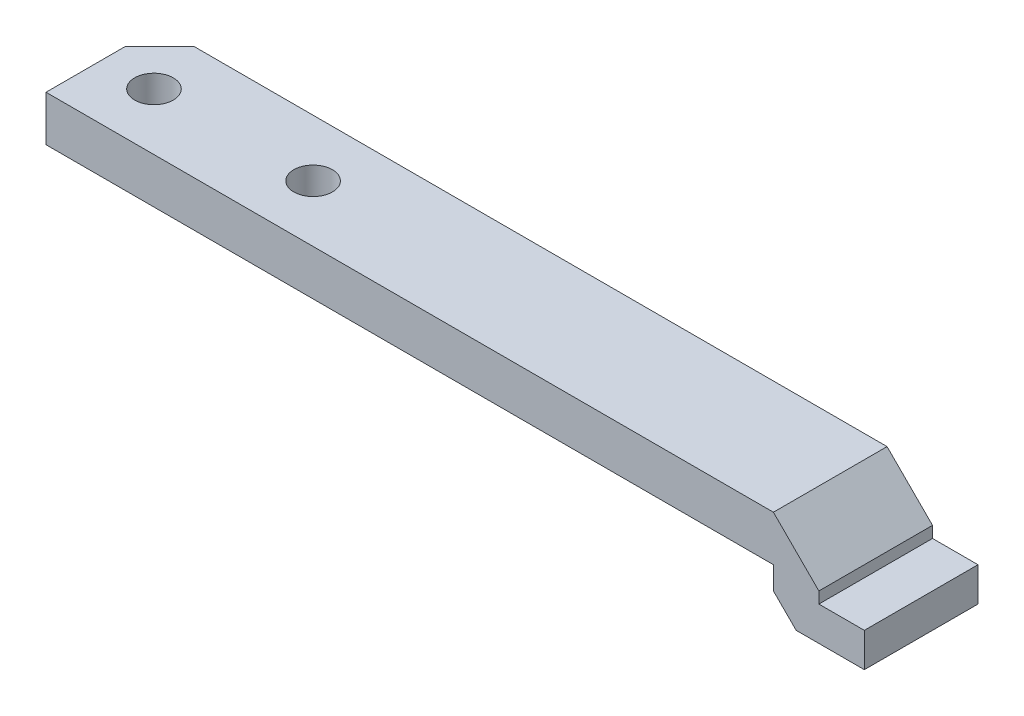
ISO-10303-21;
HEADER;
FILE_DESCRIPTION(('STEP AP214'),'2;1');
FILE_NAME('part.step','',(''),(''),'','','');
FILE_SCHEMA(('AUTOMOTIVE_DESIGN { 1 0 10303 214 1 1 1 1 }'));
ENDSEC;
DATA;
#1=APPLICATION_CONTEXT('core data for automotive mechanical design processes');
#2=APPLICATION_PROTOCOL_DEFINITION('international standard','automotive_design',2000,#1);
#3=PRODUCT_CONTEXT('',#1,'mechanical');
#4=PRODUCT('Part','Part','',(#3));
#5=PRODUCT_RELATED_PRODUCT_CATEGORY('part','',(#4));
#6=PRODUCT_DEFINITION_FORMATION('','',#4);
#7=PRODUCT_DEFINITION_CONTEXT('part definition',#1,'design');
#8=PRODUCT_DEFINITION('design','',#6,#7);
#9=PRODUCT_DEFINITION_SHAPE('','',#8);
#10=(LENGTH_UNIT() NAMED_UNIT(*) SI_UNIT(.MILLI.,.METRE.));
#11=(NAMED_UNIT(*) PLANE_ANGLE_UNIT() SI_UNIT($,.RADIAN.));
#12=(NAMED_UNIT(*) SI_UNIT($,.STERADIAN.) SOLID_ANGLE_UNIT());
#13=UNCERTAINTY_MEASURE_WITH_UNIT(LENGTH_MEASURE(1.E-05),#10,'distance_accuracy_value','');
#14=(GEOMETRIC_REPRESENTATION_CONTEXT(3) GLOBAL_UNCERTAINTY_ASSIGNED_CONTEXT((#13)) GLOBAL_UNIT_ASSIGNED_CONTEXT((#10,
#11,#12)) REPRESENTATION_CONTEXT('',''));
#15=CARTESIAN_POINT('',(0.,0.,0.));
#16=DIRECTION('',(0.,0.,1.));
#17=DIRECTION('',(1.,0.,0.));
#18=AXIS2_PLACEMENT_3D('',#15,#16,#17);
#19=CARTESIAN_POINT('',(26.3314487114034,2.49773558261549,10.));
#20=DIRECTION('',(-1.,0.,0.));
#21=DIRECTION('',(0.,0.,1.));
#22=AXIS2_PLACEMENT_3D('',#19,#20,#21);
#23=PLANE('',#22);
#24=DIRECTION('',(0.,1.,0.));
#25=VECTOR('',#24,1.);
#26=CARTESIAN_POINT('',(26.3314487114034,2.49773558261549,0.));
#27=LINE('',#26,#25);
#28=CARTESIAN_POINT('',(26.3314487114034,2.49773558261549,0.));
#29=VERTEX_POINT('',#28);
#30=CARTESIAN_POINT('',(26.3314487114034,3.49773558261547,0.));
#31=VERTEX_POINT('',#30);
#32=EDGE_CURVE('E157',#29,#31,#27,.T.);
#33=ORIENTED_EDGE('',*,*,#32,.T.);
#34=DIRECTION('',(0.,0.,1.));
#35=VECTOR('',#34,1.);
#36=CARTESIAN_POINT('',(26.3314487114034,3.49773558261547,10.));
#37=LINE('',#36,#35);
#38=CARTESIAN_POINT('',(26.3314487114034,3.49773558261547,10.));
#39=VERTEX_POINT('',#38);
#40=EDGE_CURVE('E196',#31,#39,#37,.T.);
#41=ORIENTED_EDGE('',*,*,#40,.T.);
#42=DIRECTION('',(0.,1.,0.));
#43=VECTOR('',#42,1.);
#44=CARTESIAN_POINT('',(26.3314487114034,2.49773558261549,10.));
#45=LINE('',#44,#43);
#46=CARTESIAN_POINT('',(26.3314487114034,2.49773558261549,10.));
#47=VERTEX_POINT('',#46);
#48=EDGE_CURVE('E127',#47,#39,#45,.T.);
#49=ORIENTED_EDGE('',*,*,#48,.F.);
#50=DIRECTION('',(0.,0.,-1.));
#51=VECTOR('',#50,1.);
#52=CARTESIAN_POINT('',(26.3314487114034,2.49773558261549,10.));
#53=LINE('',#52,#51);
#54=EDGE_CURVE('E156',#47,#29,#53,.T.);
#55=ORIENTED_EDGE('',*,*,#54,.T.);
#56=EDGE_LOOP('',(#33,#41,#49,#55));
#57=FACE_BOUND('',#56,.T.);
#58=ADVANCED_FACE('F33',(#57),#23,.F.);
#59=CARTESIAN_POINT('',(26.3314487114034,7.49773558261549,10.));
#60=DIRECTION('',(0.,-1.,0.));
#61=DIRECTION('',(1.,0.,0.));
#62=AXIS2_PLACEMENT_3D('',#59,#60,#61);
#63=PLANE('',#62);
#64=CARTESIAN_POINT('',(-23.1685512885966,7.49773558261548,5.));
#65=DIRECTION('',(0.,1.,0.));
#66=DIRECTION('',(-1.,0.,0.));
#67=AXIS2_PLACEMENT_3D('',#64,#65,#66);
#68=CIRCLE('',#67,1.7);
#69=CARTESIAN_POINT('',(-24.8685512885966,7.49773558261548,5.));
#70=VERTEX_POINT('',#69);
#71=EDGE_CURVE('E360',#70,#70,#68,.T.);
#72=ORIENTED_EDGE('',*,*,#71,.F.);
#73=EDGE_LOOP('',(#72));
#74=FACE_BOUND('',#73,.T.);
#75=CARTESIAN_POINT('',(-37.1685512885966,7.49773558261547,5.));
#76=DIRECTION('',(0.,1.,0.));
#77=DIRECTION('',(-1.,0.,0.));
#78=AXIS2_PLACEMENT_3D('',#75,#76,#77);
#79=CIRCLE('',#78,1.7);
#80=CARTESIAN_POINT('',(-38.8685512885966,7.49773558261547,5.));
#81=VERTEX_POINT('',#80);
#82=EDGE_CURVE('E365',#81,#81,#79,.T.);
#83=ORIENTED_EDGE('',*,*,#82,.F.);
#84=EDGE_LOOP('',(#83));
#85=FACE_BOUND('',#84,.T.);
#86=DIRECTION('',(-1.,0.,0.));
#87=VECTOR('',#86,1.);
#88=CARTESIAN_POINT('',(26.3314487114034,7.49773558261549,10.));
#89=LINE('',#88,#87);
#90=CARTESIAN_POINT('',(22.3314487114034,7.49773558261549,10.));
#91=VERTEX_POINT('',#90);
#92=CARTESIAN_POINT('',(-41.6685512885966,7.49773558261547,10.));
#93=VERTEX_POINT('',#92);
#94=EDGE_CURVE('E115',#91,#93,#89,.T.);
#95=ORIENTED_EDGE('',*,*,#94,.F.);
#96=DIRECTION('',(0.,0.,-1.));
#97=VECTOR('',#96,1.);
#98=CARTESIAN_POINT('',(22.3314487114034,7.49773558261549,10.));
#99=LINE('',#98,#97);
#100=CARTESIAN_POINT('',(22.3314487114034,7.49773558261549,0.));
#101=VERTEX_POINT('',#100);
#102=EDGE_CURVE('E192',#91,#101,#99,.T.);
#103=ORIENTED_EDGE('',*,*,#102,.T.);
#104=DIRECTION('',(-1.,0.,0.));
#105=VECTOR('',#104,1.);
#106=CARTESIAN_POINT('',(26.3314487114034,7.49773558261549,0.));
#107=LINE('',#106,#105);
#108=CARTESIAN_POINT('',(-38.6685512885965,7.49773558261547,0.));
#109=VERTEX_POINT('',#108);
#110=EDGE_CURVE('E160',#101,#109,#107,.T.);
#111=ORIENTED_EDGE('',*,*,#110,.T.);
#112=DIRECTION('',(0.707106781186548,0.,-0.707106781186547));
#113=VECTOR('',#112,1.);
#114=CARTESIAN_POINT('',(-41.6685512885966,7.49773558261547,3.00000000000002));
#115=LINE('',#114,#113);
#116=CARTESIAN_POINT('',(-41.6685512885966,7.49773558261547,3.00000000000002));
#117=VERTEX_POINT('',#116);
#118=EDGE_CURVE('E133',#109,#117,#115,.F.);
#119=ORIENTED_EDGE('',*,*,#118,.T.);
#120=DIRECTION('',(0.,0.,-1.));
#121=VECTOR('',#120,1.);
#122=CARTESIAN_POINT('',(-41.6685512885966,7.49773558261547,10.));
#123=LINE('',#122,#121);
#124=EDGE_CURVE('E130',#93,#117,#123,.T.);
#125=ORIENTED_EDGE('',*,*,#124,.F.);
#126=EDGE_LOOP('',(#95,#103,#111,#119,#125));
#127=FACE_BOUND('',#126,.T.);
#128=ADVANCED_FACE('F131',(#74,#85,#127),#63,.F.);
#129=CARTESIAN_POINT('',(-41.6685512885966,7.49773558261547,10.));
#130=DIRECTION('',(1.,0.,0.));
#131=DIRECTION('',(0.,0.,-1.));
#132=AXIS2_PLACEMENT_3D('',#129,#130,#131);
#133=PLANE('',#132);
#134=ORIENTED_EDGE('',*,*,#124,.T.);
#135=DIRECTION('',(0.,-1.,0.));
#136=VECTOR('',#135,1.);
#137=CARTESIAN_POINT('',(-41.6685512885966,7.49773558261547,3.00000000000002));
#138=LINE('',#137,#136);
#139=CARTESIAN_POINT('',(-41.6685512885966,3.49773558261547,3.00000000000002));
#140=VERTEX_POINT('',#139);
#141=EDGE_CURVE('E137',#117,#140,#138,.T.);
#142=ORIENTED_EDGE('',*,*,#141,.T.);
#143=DIRECTION('',(0.,0.,-1.));
#144=VECTOR('',#143,1.);
#145=CARTESIAN_POINT('',(-41.6685512885966,3.49773558261547,10.));
#146=LINE('',#145,#144);
#147=CARTESIAN_POINT('',(-41.6685512885966,3.49773558261547,10.));
#148=VERTEX_POINT('',#147);
#149=EDGE_CURVE('E138',#148,#140,#146,.T.);
#150=ORIENTED_EDGE('',*,*,#149,.F.);
#151=DIRECTION('',(0.,-1.,0.));
#152=VECTOR('',#151,1.);
#153=CARTESIAN_POINT('',(-41.6685512885966,7.49773558261547,10.));
#154=LINE('',#153,#152);
#155=EDGE_CURVE('E119',#93,#148,#154,.T.);
#156=ORIENTED_EDGE('',*,*,#155,.F.);
#157=EDGE_LOOP('',(#134,#142,#150,#156));
#158=FACE_BOUND('',#157,.T.);
#159=ADVANCED_FACE('F140',(#158),#133,.F.);
#160=CARTESIAN_POINT('',(-41.6685512885966,3.49773558261547,10.));
#161=DIRECTION('',(0.,1.,0.));
#162=DIRECTION('',(-1.,0.,0.));
#163=AXIS2_PLACEMENT_3D('',#160,#161,#162);
#164=PLANE('',#163);
#165=CARTESIAN_POINT('',(-23.1685512885966,3.49773558261548,5.));
#166=DIRECTION('',(0.,1.,0.));
#167=DIRECTION('',(-1.,0.,0.));
#168=AXIS2_PLACEMENT_3D('',#165,#166,#167);
#169=CIRCLE('',#168,1.7);
#170=CARTESIAN_POINT('',(-24.8685512885966,3.49773558261548,5.));
#171=VERTEX_POINT('',#170);
#172=EDGE_CURVE('E363',#171,#171,#169,.F.);
#173=ORIENTED_EDGE('',*,*,#172,.F.);
#174=EDGE_LOOP('',(#173));
#175=FACE_BOUND('',#174,.T.);
#176=CARTESIAN_POINT('',(-37.1685512885966,3.49773558261547,5.));
#177=DIRECTION('',(0.,1.,0.));
#178=DIRECTION('',(-1.,0.,0.));
#179=AXIS2_PLACEMENT_3D('',#176,#177,#178);
#180=CIRCLE('',#179,1.7);
#181=CARTESIAN_POINT('',(-38.8685512885966,3.49773558261547,5.));
#182=VERTEX_POINT('',#181);
#183=EDGE_CURVE('E161',#182,#182,#180,.F.);
#184=ORIENTED_EDGE('',*,*,#183,.F.);
#185=EDGE_LOOP('',(#184));
#186=FACE_BOUND('',#185,.T.);
#187=ORIENTED_EDGE('',*,*,#149,.T.);
#188=DIRECTION('',(-0.707106781186548,0.,0.707106781186547));
#189=VECTOR('',#188,1.);
#190=CARTESIAN_POINT('',(-41.6685512885966,3.49773558261547,3.00000000000002));
#191=LINE('',#190,#189);
#192=CARTESIAN_POINT('',(-38.6685512885965,3.49773558261547,0.));
#193=VERTEX_POINT('',#192);
#194=EDGE_CURVE('E186',#140,#193,#191,.F.);
#195=ORIENTED_EDGE('',*,*,#194,.T.);
#196=DIRECTION('',(1.,0.,0.));
#197=VECTOR('',#196,1.);
#198=CARTESIAN_POINT('',(-41.6685512885966,3.49773558261547,0.));
#199=LINE('',#198,#197);
#200=CARTESIAN_POINT('',(22.3314487114034,3.49773558261548,0.));
#201=VERTEX_POINT('',#200);
#202=EDGE_CURVE('E163',#193,#201,#199,.T.);
#203=ORIENTED_EDGE('',*,*,#202,.T.);
#204=DIRECTION('',(0.,0.,-1.));
#205=VECTOR('',#204,1.);
#206=CARTESIAN_POINT('',(22.3314487114034,3.49773558261548,10.));
#207=LINE('',#206,#205);
#208=CARTESIAN_POINT('',(22.3314487114034,3.49773558261548,10.));
#209=VERTEX_POINT('',#208);
#210=EDGE_CURVE('E181',#209,#201,#207,.T.);
#211=ORIENTED_EDGE('',*,*,#210,.F.);
#212=DIRECTION('',(1.,0.,0.));
#213=VECTOR('',#212,1.);
#214=CARTESIAN_POINT('',(-41.6685512885966,3.49773558261547,10.));
#215=LINE('',#214,#213);
#216=EDGE_CURVE('E143',#148,#209,#215,.T.);
#217=ORIENTED_EDGE('',*,*,#216,.F.);
#218=EDGE_LOOP('',(#187,#195,#203,#211,#217));
#219=FACE_BOUND('',#218,.T.);
#220=ADVANCED_FACE('F252',(#175,#186,#219),#164,.F.);
#221=CARTESIAN_POINT('',(22.3314487114034,3.49773558261548,10.));
#222=DIRECTION('',(1.,0.,0.));
#223=DIRECTION('',(0.,0.,-1.));
#224=AXIS2_PLACEMENT_3D('',#221,#222,#223);
#225=PLANE('',#224);
#226=DIRECTION('',(0.,-1.,0.));
#227=VECTOR('',#226,1.);
#228=CARTESIAN_POINT('',(22.3314487114034,3.49773558261548,0.));
#229=LINE('',#228,#227);
#230=CARTESIAN_POINT('',(22.3314487114034,1.4977355826155,0.));
#231=VERTEX_POINT('',#230);
#232=EDGE_CURVE('E165',#201,#231,#229,.T.);
#233=ORIENTED_EDGE('',*,*,#232,.T.);
#234=DIRECTION('',(0.,0.,1.));
#235=VECTOR('',#234,1.);
#236=CARTESIAN_POINT('',(22.3314487114034,1.4977355826155,10.));
#237=LINE('',#236,#235);
#238=CARTESIAN_POINT('',(22.3314487114034,1.4977355826155,10.));
#239=VERTEX_POINT('',#238);
#240=EDGE_CURVE('E41',#231,#239,#237,.T.);
#241=ORIENTED_EDGE('',*,*,#240,.T.);
#242=DIRECTION('',(0.,-1.,0.));
#243=VECTOR('',#242,1.);
#244=CARTESIAN_POINT('',(22.3314487114034,3.49773558261548,10.));
#245=LINE('',#244,#243);
#246=EDGE_CURVE('E145',#209,#239,#245,.T.);
#247=ORIENTED_EDGE('',*,*,#246,.F.);
#248=ORIENTED_EDGE('',*,*,#210,.T.);
#249=EDGE_LOOP('',(#233,#241,#247,#248));
#250=FACE_BOUND('',#249,.T.);
#251=ADVANCED_FACE('F255',(#250),#225,.F.);
#252=CARTESIAN_POINT('',(22.3314487114034,-0.502264417384507,10.));
#253=DIRECTION('',(0.,1.,0.));
#254=DIRECTION('',(0.,0.,1.));
#255=AXIS2_PLACEMENT_3D('',#252,#253,#254);
#256=PLANE('',#255);
#257=DIRECTION('',(1.,0.,0.));
#258=VECTOR('',#257,1.);
#259=CARTESIAN_POINT('',(22.3314487114034,-0.502264417384507,10.));
#260=LINE('',#259,#258);
#261=CARTESIAN_POINT('',(24.3314487114034,-0.502264417384507,10.));
#262=VERTEX_POINT('',#261);
#263=CARTESIAN_POINT('',(30.3314487114034,-0.502264417384507,10.));
#264=VERTEX_POINT('',#263);
#265=EDGE_CURVE('E150',#262,#264,#260,.T.);
#266=ORIENTED_EDGE('',*,*,#265,.F.);
#267=DIRECTION('',(0.,0.,-1.));
#268=VECTOR('',#267,1.);
#269=CARTESIAN_POINT('',(24.3314487114034,-0.502264417384507,10.));
#270=LINE('',#269,#268);
#271=CARTESIAN_POINT('',(24.3314487114034,-0.502264417384507,0.));
#272=VERTEX_POINT('',#271);
#273=EDGE_CURVE('E199',#262,#272,#270,.T.);
#274=ORIENTED_EDGE('',*,*,#273,.T.);
#275=DIRECTION('',(1.,0.,0.));
#276=VECTOR('',#275,1.);
#277=CARTESIAN_POINT('',(22.3314487114034,-0.502264417384507,0.));
#278=LINE('',#277,#276);
#279=CARTESIAN_POINT('',(30.3314487114034,-0.502264417384507,0.));
#280=VERTEX_POINT('',#279);
#281=EDGE_CURVE('E167',#272,#280,#278,.T.);
#282=ORIENTED_EDGE('',*,*,#281,.T.);
#283=DIRECTION('',(0.,0.,-1.));
#284=VECTOR('',#283,1.);
#285=CARTESIAN_POINT('',(30.3314487114034,-0.502264417384507,10.));
#286=LINE('',#285,#284);
#287=EDGE_CURVE('E178',#264,#280,#286,.T.);
#288=ORIENTED_EDGE('',*,*,#287,.F.);
#289=EDGE_LOOP('',(#266,#274,#282,#288));
#290=FACE_BOUND('',#289,.T.);
#291=ADVANCED_FACE('F205',(#290),#256,.F.);
#292=CARTESIAN_POINT('',(30.3314487114034,-0.502264417384507,10.));
#293=DIRECTION('',(-1.,0.,0.));
#294=DIRECTION('',(0.,0.,1.));
#295=AXIS2_PLACEMENT_3D('',#292,#293,#294);
#296=PLANE('',#295);
#297=DIRECTION('',(0.,1.,0.));
#298=VECTOR('',#297,1.);
#299=CARTESIAN_POINT('',(30.3314487114034,-0.502264417384507,0.));
#300=LINE('',#299,#298);
#301=CARTESIAN_POINT('',(30.3314487114034,2.49773558261549,0.));
#302=VERTEX_POINT('',#301);
#303=EDGE_CURVE('E169',#280,#302,#300,.T.);
#304=ORIENTED_EDGE('',*,*,#303,.T.);
#305=DIRECTION('',(0.,0.,-1.));
#306=VECTOR('',#305,1.);
#307=CARTESIAN_POINT('',(30.3314487114034,2.49773558261549,10.));
#308=LINE('',#307,#306);
#309=CARTESIAN_POINT('',(30.3314487114034,2.49773558261549,10.));
#310=VERTEX_POINT('',#309);
#311=EDGE_CURVE('E175',#310,#302,#308,.T.);
#312=ORIENTED_EDGE('',*,*,#311,.F.);
#313=DIRECTION('',(0.,1.,0.));
#314=VECTOR('',#313,1.);
#315=CARTESIAN_POINT('',(30.3314487114034,-0.502264417384507,10.));
#316=LINE('',#315,#314);
#317=EDGE_CURVE('E152',#264,#310,#316,.T.);
#318=ORIENTED_EDGE('',*,*,#317,.F.);
#319=ORIENTED_EDGE('',*,*,#287,.T.);
#320=EDGE_LOOP('',(#304,#312,#318,#319));
#321=FACE_BOUND('',#320,.T.);
#322=ADVANCED_FACE('F215',(#321),#296,.F.);
#323=CARTESIAN_POINT('',(30.3314487114034,2.49773558261549,10.));
#324=DIRECTION('',(0.,-1.,0.));
#325=DIRECTION('',(1.,0.,0.));
#326=AXIS2_PLACEMENT_3D('',#323,#324,#325);
#327=PLANE('',#326);
#328=DIRECTION('',(-1.,0.,0.));
#329=VECTOR('',#328,1.);
#330=CARTESIAN_POINT('',(30.3314487114034,2.49773558261549,0.));
#331=LINE('',#330,#329);
#332=EDGE_CURVE('E171',#302,#29,#331,.T.);
#333=ORIENTED_EDGE('',*,*,#332,.T.);
#334=ORIENTED_EDGE('',*,*,#54,.F.);
#335=DIRECTION('',(-1.,0.,0.));
#336=VECTOR('',#335,1.);
#337=CARTESIAN_POINT('',(30.3314487114034,2.49773558261549,10.));
#338=LINE('',#337,#336);
#339=EDGE_CURVE('E154',#310,#47,#338,.T.);
#340=ORIENTED_EDGE('',*,*,#339,.F.);
#341=ORIENTED_EDGE('',*,*,#311,.T.);
#342=EDGE_LOOP('',(#333,#334,#340,#341));
#343=FACE_BOUND('',#342,.T.);
#344=ADVANCED_FACE('F219',(#343),#327,.F.);
#345=CARTESIAN_POINT('',(0.,0.,10.));
#346=DIRECTION('',(0.,0.,1.));
#347=DIRECTION('',(1.,0.,0.));
#348=AXIS2_PLACEMENT_3D('',#345,#346,#347);
#349=PLANE('',#348);
#350=ORIENTED_EDGE('',*,*,#246,.T.);
#351=DIRECTION('',(-0.707106781186545,0.70710678118655,0.));
#352=VECTOR('',#351,1.);
#353=CARTESIAN_POINT('',(11.9145921470095,11.9145921470095,10.));
#354=LINE('',#353,#352);
#355=EDGE_CURVE('E11',#239,#262,#354,.F.);
#356=ORIENTED_EDGE('',*,*,#355,.T.);
#357=ORIENTED_EDGE('',*,*,#265,.T.);
#358=ORIENTED_EDGE('',*,*,#317,.T.);
#359=ORIENTED_EDGE('',*,*,#339,.T.);
#360=ORIENTED_EDGE('',*,*,#48,.T.);
#361=DIRECTION('',(0.707106781186546,-0.707106781186549,0.));
#362=VECTOR('',#361,1.);
#363=CARTESIAN_POINT('',(14.9145921470095,14.9145921470094,10.));
#364=LINE('',#363,#362);
#365=EDGE_CURVE('E123',#39,#91,#364,.F.);
#366=ORIENTED_EDGE('',*,*,#365,.T.);
#367=ORIENTED_EDGE('',*,*,#94,.T.);
#368=ORIENTED_EDGE('',*,*,#155,.T.);
#369=ORIENTED_EDGE('',*,*,#216,.T.);
#370=EDGE_LOOP('',(#350,#356,#357,#358,#359,#360,#366,#367,#368,#369));
#371=FACE_BOUND('',#370,.T.);
#372=ADVANCED_FACE('F117',(#371),#349,.T.);
#373=CARTESIAN_POINT('',(0.,0.,0.));
#374=DIRECTION('',(0.,0.,1.));
#375=DIRECTION('',(1.,0.,0.));
#376=AXIS2_PLACEMENT_3D('',#373,#374,#375);
#377=PLANE('',#376);
#378=ORIENTED_EDGE('',*,*,#281,.F.);
#379=DIRECTION('',(0.707106781186545,-0.70710678118655,0.));
#380=VECTOR('',#379,1.);
#381=CARTESIAN_POINT('',(24.3314487114034,-0.502264417384507,0.));
#382=LINE('',#381,#380);
#383=EDGE_CURVE('E55',#272,#231,#382,.F.);
#384=ORIENTED_EDGE('',*,*,#383,.T.);
#385=ORIENTED_EDGE('',*,*,#232,.F.);
#386=ORIENTED_EDGE('',*,*,#202,.F.);
#387=DIRECTION('',(0.,1.,0.));
#388=VECTOR('',#387,1.);
#389=CARTESIAN_POINT('',(-38.6685512885965,0.,0.));
#390=LINE('',#389,#388);
#391=EDGE_CURVE('E188',#193,#109,#390,.T.);
#392=ORIENTED_EDGE('',*,*,#391,.T.);
#393=ORIENTED_EDGE('',*,*,#110,.F.);
#394=DIRECTION('',(-0.707106781186546,0.707106781186549,0.));
#395=VECTOR('',#394,1.);
#396=CARTESIAN_POINT('',(22.3314487114034,7.49773558261549,0.));
#397=LINE('',#396,#395);
#398=EDGE_CURVE('E194',#101,#31,#397,.F.);
#399=ORIENTED_EDGE('',*,*,#398,.T.);
#400=ORIENTED_EDGE('',*,*,#32,.F.);
#401=ORIENTED_EDGE('',*,*,#332,.F.);
#402=ORIENTED_EDGE('',*,*,#303,.F.);
#403=EDGE_LOOP('',(#378,#384,#385,#386,#392,#393,#399,#400,#401,#402));
#404=FACE_BOUND('',#403,.T.);
#405=ADVANCED_FACE('F210',(#404),#377,.F.);
#406=CARTESIAN_POINT('',(-41.6685512885966,7.49773558261547,3.00000000000002));
#407=DIRECTION('',(0.707106781186547,0.,0.707106781186548));
#408=DIRECTION('',(0.,-1.,0.));
#409=AXIS2_PLACEMENT_3D('',#406,#407,#408);
#410=PLANE('',#409);
#411=ORIENTED_EDGE('',*,*,#118,.F.);
#412=ORIENTED_EDGE('',*,*,#391,.F.);
#413=ORIENTED_EDGE('',*,*,#194,.F.);
#414=ORIENTED_EDGE('',*,*,#141,.F.);
#415=EDGE_LOOP('',(#411,#412,#413,#414));
#416=FACE_BOUND('',#415,.T.);
#417=ADVANCED_FACE('F232',(#416),#410,.F.);
#418=CARTESIAN_POINT('',(22.3314487114034,7.49773558261549,10.));
#419=DIRECTION('',(-0.707106781186549,-0.707106781186546,0.));
#420=DIRECTION('',(0.,0.,-1.));
#421=AXIS2_PLACEMENT_3D('',#418,#419,#420);
#422=PLANE('',#421);
#423=ORIENTED_EDGE('',*,*,#365,.F.);
#424=ORIENTED_EDGE('',*,*,#40,.F.);
#425=ORIENTED_EDGE('',*,*,#398,.F.);
#426=ORIENTED_EDGE('',*,*,#102,.F.);
#427=EDGE_LOOP('',(#423,#424,#425,#426));
#428=FACE_BOUND('',#427,.T.);
#429=ADVANCED_FACE('F224',(#428),#422,.F.);
#430=CARTESIAN_POINT('',(24.3314487114034,-0.502264417384507,10.));
#431=DIRECTION('',(0.70710678118655,0.707106781186545,0.));
#432=DIRECTION('',(0.,0.,-1.));
#433=AXIS2_PLACEMENT_3D('',#430,#431,#432);
#434=PLANE('',#433);
#435=ORIENTED_EDGE('',*,*,#355,.F.);
#436=ORIENTED_EDGE('',*,*,#240,.F.);
#437=ORIENTED_EDGE('',*,*,#383,.F.);
#438=ORIENTED_EDGE('',*,*,#273,.F.);
#439=EDGE_LOOP('',(#435,#436,#437,#438));
#440=FACE_BOUND('',#439,.T.);
#441=ADVANCED_FACE('F35',(#440),#434,.F.);
#442=CARTESIAN_POINT('',(-37.1685512885966,-0.503264417384527,5.));
#443=DIRECTION('',(0.,1.,0.));
#444=DIRECTION('',(-1.,0.,0.));
#445=AXIS2_PLACEMENT_3D('',#442,#443,#444);
#446=CYLINDRICAL_SURFACE('',#445,1.7);
#447=ORIENTED_EDGE('',*,*,#82,.T.);
#448=EDGE_LOOP('',(#447));
#449=FACE_BOUND('',#448,.T.);
#450=ORIENTED_EDGE('',*,*,#183,.T.);
#451=EDGE_LOOP('',(#450));
#452=FACE_BOUND('',#451,.T.);
#453=ADVANCED_FACE('F223',(#449,#452),#446,.F.);
#454=CARTESIAN_POINT('',(-23.1685512885966,-0.503264417384523,5.));
#455=DIRECTION('',(0.,1.,0.));
#456=DIRECTION('',(-1.,0.,0.));
#457=AXIS2_PLACEMENT_3D('',#454,#455,#456);
#458=CYLINDRICAL_SURFACE('',#457,1.7);
#459=ORIENTED_EDGE('',*,*,#71,.T.);
#460=EDGE_LOOP('',(#459));
#461=FACE_BOUND('',#460,.T.);
#462=ORIENTED_EDGE('',*,*,#172,.T.);
#463=EDGE_LOOP('',(#462));
#464=FACE_BOUND('',#463,.T.);
#465=ADVANCED_FACE('F229',(#461,#464),#458,.F.);
#466=CLOSED_SHELL('',(#58,#128,#159,#220,#251,#291,#322,#344,#372,#405,#417,#429,#441,#453,#465));
#467=MANIFOLD_SOLID_BREP('B2',#466);
#468=ADVANCED_BREP_SHAPE_REPRESENTATION('',(#18,#467),#14);
#469=SHAPE_DEFINITION_REPRESENTATION(#9,#468);
ENDSEC;
END-ISO-10303-21;
